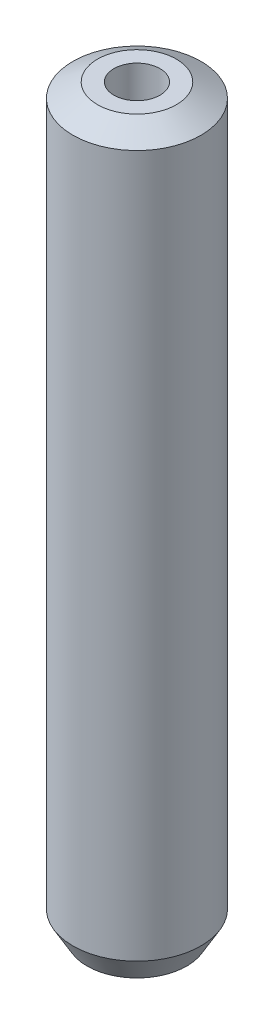
ISO-10303-21;
HEADER;
FILE_DESCRIPTION(('STEP AP214'),'2;1');
FILE_NAME('part.step','',(''),(''),'','','');
FILE_SCHEMA(('AUTOMOTIVE_DESIGN { 1 0 10303 214 1 1 1 1 }'));
ENDSEC;
DATA;
#1=APPLICATION_CONTEXT('core data for automotive mechanical design processes');
#2=APPLICATION_PROTOCOL_DEFINITION('international standard','automotive_design',2000,#1);
#3=PRODUCT_CONTEXT('',#1,'mechanical');
#4=PRODUCT('Part','Part','',(#3));
#5=PRODUCT_RELATED_PRODUCT_CATEGORY('part','',(#4));
#6=PRODUCT_DEFINITION_FORMATION('','',#4);
#7=PRODUCT_DEFINITION_CONTEXT('part definition',#1,'design');
#8=PRODUCT_DEFINITION('design','',#6,#7);
#9=PRODUCT_DEFINITION_SHAPE('','',#8);
#10=(LENGTH_UNIT() NAMED_UNIT(*) SI_UNIT(.MILLI.,.METRE.));
#11=(NAMED_UNIT(*) PLANE_ANGLE_UNIT() SI_UNIT($,.RADIAN.));
#12=(NAMED_UNIT(*) SI_UNIT($,.STERADIAN.) SOLID_ANGLE_UNIT());
#13=UNCERTAINTY_MEASURE_WITH_UNIT(LENGTH_MEASURE(1.E-05),#10,'distance_accuracy_value','');
#14=(GEOMETRIC_REPRESENTATION_CONTEXT(3) GLOBAL_UNCERTAINTY_ASSIGNED_CONTEXT((#13)) GLOBAL_UNIT_ASSIGNED_CONTEXT((#10,
#11,#12)) REPRESENTATION_CONTEXT('',''));
#15=CARTESIAN_POINT('',(0.,0.,0.));
#16=DIRECTION('',(0.,0.,1.));
#17=DIRECTION('',(1.,0.,0.));
#18=AXIS2_PLACEMENT_3D('',#15,#16,#17);
#19=CARTESIAN_POINT('',(0.,86.7571500288497,0.));
#20=DIRECTION('',(0.,-1.,0.));
#21=DIRECTION('',(0.,0.,-1.));
#22=AXIS2_PLACEMENT_3D('',#19,#20,#21);
#23=CYLINDRICAL_SURFACE('',#22,7.5);
#24=CARTESIAN_POINT('',(0.,85.0956617603383,0.));
#25=DIRECTION('',(0.,1.,0.));
#26=DIRECTION('',(0.,0.,1.));
#27=AXIS2_PLACEMENT_3D('',#24,#25,#26);
#28=CIRCLE('',#27,7.5);
#29=CARTESIAN_POINT('',(0.,85.0956617603383,7.5));
#30=VERTEX_POINT('',#29);
#31=EDGE_CURVE('E50',#30,#30,#28,.F.);
#32=ORIENTED_EDGE('',*,*,#31,.T.);
#33=EDGE_LOOP('',(#32));
#34=FACE_BOUND('',#33,.T.);
#35=CARTESIAN_POINT('',(0.,2.8777820972414,0.));
#36=DIRECTION('',(0.,1.,0.));
#37=DIRECTION('',(0.,0.,1.));
#38=AXIS2_PLACEMENT_3D('',#35,#36,#37);
#39=CIRCLE('',#38,7.5);
#40=CARTESIAN_POINT('',(0.,2.8777820972414,7.5));
#41=VERTEX_POINT('',#40);
#42=EDGE_CURVE('E51',#41,#41,#39,.T.);
#43=ORIENTED_EDGE('',*,*,#42,.T.);
#44=EDGE_LOOP('',(#43));
#45=FACE_BOUND('',#44,.T.);
#46=ADVANCED_FACE('F39',(#34,#45),#23,.T.);
#47=CARTESIAN_POINT('',(0.,86.7571500288497,0.));
#48=DIRECTION('',(0.,1.,0.));
#49=DIRECTION('',(0.,0.,1.));
#50=AXIS2_PLACEMENT_3D('',#47,#48,#49);
#51=PLANE('',#50);
#52=CARTESIAN_POINT('',(0.,86.7571500288497,0.));
#53=DIRECTION('',(0.,1.,0.));
#54=DIRECTION('',(0.,0.,1.));
#55=AXIS2_PLACEMENT_3D('',#52,#53,#54);
#56=CIRCLE('',#55,4.62221790275862);
#57=CARTESIAN_POINT('',(0.,86.7571500288497,4.62221790275862));
#58=VERTEX_POINT('',#57);
#59=EDGE_CURVE('E54',#58,#58,#56,.T.);
#60=ORIENTED_EDGE('',*,*,#59,.T.);
#61=EDGE_LOOP('',(#60));
#62=FACE_BOUND('',#61,.T.);
#63=CARTESIAN_POINT('',(0.,86.7571500288497,0.));
#64=DIRECTION('',(0.,1.,0.));
#65=DIRECTION('',(0.,0.,1.));
#66=AXIS2_PLACEMENT_3D('',#63,#64,#65);
#67=CIRCLE('',#66,2.69998187987154);
#68=CARTESIAN_POINT('',(0.,86.7571500288497,2.69998187987154));
#69=VERTEX_POINT('',#68);
#70=EDGE_CURVE('E58',#69,#69,#67,.T.);
#71=ORIENTED_EDGE('',*,*,#70,.F.);
#72=EDGE_LOOP('',(#71));
#73=FACE_BOUND('',#72,.T.);
#74=ADVANCED_FACE('F69',(#62,#73),#51,.T.);
#75=CARTESIAN_POINT('',(0.,0.,0.));
#76=DIRECTION('',(0.,1.,0.));
#77=DIRECTION('',(0.,0.,1.));
#78=AXIS2_PLACEMENT_3D('',#75,#76,#77);
#79=PLANE('',#78);
#80=CARTESIAN_POINT('',(0.,0.,0.));
#81=DIRECTION('',(0.,1.,0.));
#82=DIRECTION('',(0.,0.,1.));
#83=AXIS2_PLACEMENT_3D('',#80,#81,#82);
#84=CIRCLE('',#83,5.83851173148858);
#85=CARTESIAN_POINT('',(0.,0.,5.83851173148858));
#86=VERTEX_POINT('',#85);
#87=EDGE_CURVE('E10',#86,#86,#84,.F.);
#88=ORIENTED_EDGE('',*,*,#87,.T.);
#89=EDGE_LOOP('',(#88));
#90=FACE_BOUND('',#89,.T.);
#91=CARTESIAN_POINT('',(0.,0.,0.));
#92=DIRECTION('',(0.,1.,0.));
#93=DIRECTION('',(0.,0.,1.));
#94=AXIS2_PLACEMENT_3D('',#91,#92,#93);
#95=CIRCLE('',#94,2.69998187987154);
#96=CARTESIAN_POINT('',(0.,0.,2.69998187987154));
#97=VERTEX_POINT('',#96);
#98=EDGE_CURVE('E63',#97,#97,#95,.T.);
#99=ORIENTED_EDGE('',*,*,#98,.T.);
#100=EDGE_LOOP('',(#99));
#101=FACE_BOUND('',#100,.T.);
#102=ADVANCED_FACE('F75',(#90,#101),#79,.F.);
#103=CARTESIAN_POINT('',(0.,86.7571500288497,0.));
#104=DIRECTION('',(0.,-1.,0.));
#105=DIRECTION('',(0.,0.,-1.));
#106=AXIS2_PLACEMENT_3D('',#103,#104,#105);
#107=CYLINDRICAL_SURFACE('',#106,2.69998187987154);
#108=ORIENTED_EDGE('',*,*,#70,.T.);
#109=EDGE_LOOP('',(#108));
#110=FACE_BOUND('',#109,.T.);
#111=ORIENTED_EDGE('',*,*,#98,.F.);
#112=EDGE_LOOP('',(#111));
#113=FACE_BOUND('',#112,.T.);
#114=ADVANCED_FACE('F70',(#110,#113),#107,.F.);
#115=CARTESIAN_POINT('',(0.,86.7571500288497,0.));
#116=DIRECTION('',(0.,-1.,0.));
#117=DIRECTION('',(0.,0.,-1.));
#118=AXIS2_PLACEMENT_3D('',#115,#116,#117);
#119=CONICAL_SURFACE('',#118,4.62221790275862,1.04719755119659);
#120=ORIENTED_EDGE('',*,*,#31,.F.);
#121=EDGE_LOOP('',(#120));
#122=FACE_BOUND('',#121,.T.);
#123=ORIENTED_EDGE('',*,*,#59,.F.);
#124=EDGE_LOOP('',(#123));
#125=FACE_BOUND('',#124,.T.);
#126=ADVANCED_FACE('F81',(#122,#125),#119,.T.);
#127=CARTESIAN_POINT('',(0.,2.8777820972414,0.));
#128=DIRECTION('',(0.,1.,0.));
#129=DIRECTION('',(0.,0.,1.));
#130=AXIS2_PLACEMENT_3D('',#127,#128,#129);
#131=CONICAL_SURFACE('',#130,7.5,0.523598775598301);
#132=ORIENTED_EDGE('',*,*,#87,.F.);
#133=EDGE_LOOP('',(#132));
#134=FACE_BOUND('',#133,.T.);
#135=ORIENTED_EDGE('',*,*,#42,.F.);
#136=EDGE_LOOP('',(#135));
#137=FACE_BOUND('',#136,.T.);
#138=ADVANCED_FACE('F45',(#134,#137),#131,.T.);
#139=CLOSED_SHELL('',(#46,#74,#102,#114,#126,#138));
#140=MANIFOLD_SOLID_BREP('B2',#139);
#141=ADVANCED_BREP_SHAPE_REPRESENTATION('',(#18,#140),#14);
#142=SHAPE_DEFINITION_REPRESENTATION(#9,#141);
ENDSEC;
END-ISO-10303-21;
